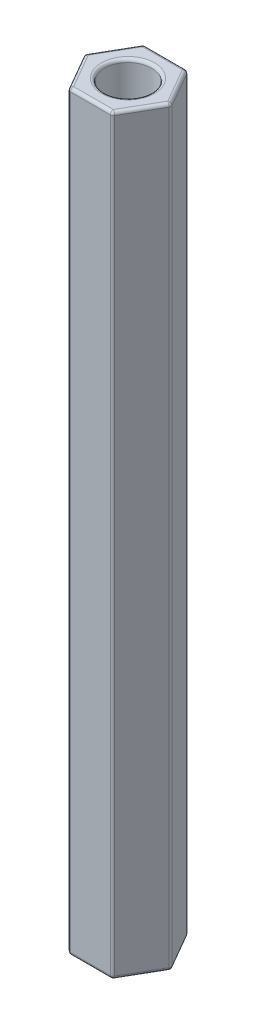
ISO-10303-21;
HEADER;
FILE_DESCRIPTION(('STEP AP214'),'2;1');
FILE_NAME('part.step','',(''),(''),'','','');
FILE_SCHEMA(('AUTOMOTIVE_DESIGN { 1 0 10303 214 1 1 1 1 }'));
ENDSEC;
DATA;
#1=APPLICATION_CONTEXT('core data for automotive mechanical design processes');
#2=APPLICATION_PROTOCOL_DEFINITION('international standard','automotive_design',2000,#1);
#3=PRODUCT_CONTEXT('',#1,'mechanical');
#4=PRODUCT('Part','Part','',(#3));
#5=PRODUCT_RELATED_PRODUCT_CATEGORY('part','',(#4));
#6=PRODUCT_DEFINITION_FORMATION('','',#4);
#7=PRODUCT_DEFINITION_CONTEXT('part definition',#1,'design');
#8=PRODUCT_DEFINITION('design','',#6,#7);
#9=PRODUCT_DEFINITION_SHAPE('','',#8);
#10=(LENGTH_UNIT() NAMED_UNIT(*) SI_UNIT(.MILLI.,.METRE.));
#11=(NAMED_UNIT(*) PLANE_ANGLE_UNIT() SI_UNIT($,.RADIAN.));
#12=(NAMED_UNIT(*) SI_UNIT($,.STERADIAN.) SOLID_ANGLE_UNIT());
#13=UNCERTAINTY_MEASURE_WITH_UNIT(LENGTH_MEASURE(1.E-05),#10,'distance_accuracy_value','');
#14=(GEOMETRIC_REPRESENTATION_CONTEXT(3) GLOBAL_UNCERTAINTY_ASSIGNED_CONTEXT((#13)) GLOBAL_UNIT_ASSIGNED_CONTEXT((#10,
#11,#12)) REPRESENTATION_CONTEXT('',''));
#15=CARTESIAN_POINT('',(0.,0.,0.));
#16=DIRECTION('',(0.,0.,1.));
#17=DIRECTION('',(1.,0.,0.));
#18=AXIS2_PLACEMENT_3D('',#15,#16,#17);
#19=CARTESIAN_POINT('',(0.,30.,0.));
#20=DIRECTION('',(0.,1.,0.));
#21=DIRECTION('',(0.,0.,1.));
#22=AXIS2_PLACEMENT_3D('',#19,#20,#21);
#23=PLANE('',#22);
#24=DIRECTION('',(0.500000000000004,0.,0.866025403784436));
#25=VECTOR('',#24,1.);
#26=CARTESIAN_POINT('',(-1.51554445662275,30.,2.87500000000002));
#27=LINE('',#26,#25);
#28=CARTESIAN_POINT('',(-3.17542648054294,30.,0.));
#29=VERTEX_POINT('',#28);
#30=CARTESIAN_POINT('',(-1.58771324027145,30.,2.75000000000002));
#31=VERTEX_POINT('',#30);
#32=EDGE_CURVE('E174',#29,#31,#27,.T.);
#33=ORIENTED_EDGE('',*,*,#32,.T.);
#34=DIRECTION('',(1.,0.,0.));
#35=VECTOR('',#34,1.);
#36=CARTESIAN_POINT('',(1.73205080756889,30.,2.75000000000001));
#37=LINE('',#36,#35);
#38=CARTESIAN_POINT('',(1.58771324027148,30.,2.75000000000001));
#39=VERTEX_POINT('',#38);
#40=EDGE_CURVE('E252',#31,#39,#37,.T.);
#41=ORIENTED_EDGE('',*,*,#40,.T.);
#42=DIRECTION('',(0.499999999999997,0.,-0.86602540378444));
#43=VECTOR('',#42,1.);
#44=CARTESIAN_POINT('',(3.24759526419165,30.,-0.125));
#45=LINE('',#44,#43);
#46=CARTESIAN_POINT('',(3.17542648054295,30.,0.));
#47=VERTEX_POINT('',#46);
#48=EDGE_CURVE('E250',#39,#47,#45,.T.);
#49=ORIENTED_EDGE('',*,*,#48,.T.);
#50=DIRECTION('',(-0.500000000000002,0.,-0.866025403784437));
#51=VECTOR('',#50,1.);
#52=CARTESIAN_POINT('',(1.51554445662276,30.,-2.87500000000001));
#53=LINE('',#52,#51);
#54=CARTESIAN_POINT('',(1.58771324027146,30.,-2.75000000000001));
#55=VERTEX_POINT('',#54);
#56=EDGE_CURVE('E169',#47,#55,#53,.T.);
#57=ORIENTED_EDGE('',*,*,#56,.T.);
#58=DIRECTION('',(-1.,0.,0.));
#59=VECTOR('',#58,1.);
#60=CARTESIAN_POINT('',(-1.73205080756888,30.,-2.74999999999999));
#61=LINE('',#60,#59);
#62=CARTESIAN_POINT('',(-1.58771324027147,30.,-2.74999999999999));
#63=VERTEX_POINT('',#62);
#64=EDGE_CURVE('E162',#55,#63,#61,.T.);
#65=ORIENTED_EDGE('',*,*,#64,.T.);
#66=DIRECTION('',(-0.499999999999998,0.,0.86602540378444));
#67=VECTOR('',#66,1.);
#68=CARTESIAN_POINT('',(-3.24759526419164,30.,0.125000000000017));
#69=LINE('',#68,#67);
#70=EDGE_CURVE('E165',#63,#29,#69,.T.);
#71=ORIENTED_EDGE('',*,*,#70,.T.);
#72=EDGE_LOOP('',(#33,#41,#49,#57,#65,#71));
#73=FACE_BOUND('',#72,.T.);
#74=CARTESIAN_POINT('',(0.,30.,0.));
#75=DIRECTION('',(0.,1.,0.));
#76=DIRECTION('',(0.,0.,1.));
#77=AXIS2_PLACEMENT_3D('',#74,#75,#76);
#78=CIRCLE('',#77,2.125);
#79=CARTESIAN_POINT('',(0.,30.,2.125));
#80=VERTEX_POINT('',#79);
#81=EDGE_CURVE('E185',#80,#80,#78,.F.);
#82=ORIENTED_EDGE('',*,*,#81,.T.);
#83=EDGE_LOOP('',(#82));
#84=FACE_BOUND('',#83,.T.);
#85=ADVANCED_FACE('F37',(#73,#84),#23,.T.);
#86=CARTESIAN_POINT('',(0.,-30.,0.));
#87=DIRECTION('',(0.,1.,0.));
#88=DIRECTION('',(0.,0.,1.));
#89=AXIS2_PLACEMENT_3D('',#86,#87,#88);
#90=PLANE('',#89);
#91=DIRECTION('',(0.499999999999997,0.,-0.86602540378444));
#92=VECTOR('',#91,1.);
#93=CARTESIAN_POINT('',(2.38156986040722,-30.,1.375));
#94=LINE('',#93,#92);
#95=CARTESIAN_POINT('',(3.17542648054295,-30.,0.));
#96=VERTEX_POINT('',#95);
#97=CARTESIAN_POINT('',(1.58771324027148,-30.,2.75000000000001));
#98=VERTEX_POINT('',#97);
#99=EDGE_CURVE('E274',#96,#98,#94,.F.);
#100=ORIENTED_EDGE('',*,*,#99,.T.);
#101=DIRECTION('',(1.,0.,0.));
#102=VECTOR('',#101,1.);
#103=CARTESIAN_POINT('',(0.,-30.,2.75000000000002));
#104=LINE('',#103,#102);
#105=CARTESIAN_POINT('',(-1.58771324027145,-30.,2.75000000000002));
#106=VERTEX_POINT('',#105);
#107=EDGE_CURVE('E277',#98,#106,#104,.F.);
#108=ORIENTED_EDGE('',*,*,#107,.T.);
#109=DIRECTION('',(0.500000000000004,0.,0.866025403784436));
#110=VECTOR('',#109,1.);
#111=CARTESIAN_POINT('',(-2.3815698604072,-30.,1.37500000000001));
#112=LINE('',#111,#110);
#113=CARTESIAN_POINT('',(-3.17542648054294,-30.,0.));
#114=VERTEX_POINT('',#113);
#115=EDGE_CURVE('E268',#106,#114,#112,.F.);
#116=ORIENTED_EDGE('',*,*,#115,.T.);
#117=DIRECTION('',(-0.499999999999998,0.,0.86602540378444));
#118=VECTOR('',#117,1.);
#119=CARTESIAN_POINT('',(-2.3815698604072,-30.,-1.37499999999999));
#120=LINE('',#119,#118);
#121=CARTESIAN_POINT('',(-1.58771324027147,-30.,-2.74999999999999));
#122=VERTEX_POINT('',#121);
#123=EDGE_CURVE('E266',#114,#122,#120,.F.);
#124=ORIENTED_EDGE('',*,*,#123,.T.);
#125=DIRECTION('',(-1.,0.,0.));
#126=VECTOR('',#125,1.);
#127=CARTESIAN_POINT('',(0.,-30.,-2.75));
#128=LINE('',#127,#126);
#129=CARTESIAN_POINT('',(1.58771324027146,-30.,-2.75000000000001));
#130=VERTEX_POINT('',#129);
#131=EDGE_CURVE('E270',#122,#130,#128,.F.);
#132=ORIENTED_EDGE('',*,*,#131,.T.);
#133=DIRECTION('',(-0.500000000000002,0.,-0.866025403784437));
#134=VECTOR('',#133,1.);
#135=CARTESIAN_POINT('',(2.3815698604072,-30.,-1.37500000000001));
#136=LINE('',#135,#134);
#137=EDGE_CURVE('E272',#130,#96,#136,.F.);
#138=ORIENTED_EDGE('',*,*,#137,.T.);
#139=EDGE_LOOP('',(#100,#108,#116,#124,#132,#138));
#140=FACE_BOUND('',#139,.T.);
#141=CARTESIAN_POINT('',(0.,-30.,0.));
#142=DIRECTION('',(0.,1.,0.));
#143=DIRECTION('',(0.,0.,1.));
#144=AXIS2_PLACEMENT_3D('',#141,#142,#143);
#145=CIRCLE('',#144,2.125);
#146=CARTESIAN_POINT('',(0.,-30.,2.125));
#147=VERTEX_POINT('',#146);
#148=EDGE_CURVE('E263',#147,#147,#145,.T.);
#149=ORIENTED_EDGE('',*,*,#148,.T.);
#150=EDGE_LOOP('',(#149));
#151=FACE_BOUND('',#150,.T.);
#152=ADVANCED_FACE('F434',(#140,#151),#90,.F.);
#153=CARTESIAN_POINT('',(3.46410161513776,30.,0.));
#154=DIRECTION('',(-0.866025403784437,0.,0.500000000000002));
#155=DIRECTION('',(0.500000000000002,0.,0.866025403784437));
#156=AXIS2_PLACEMENT_3D('',#153,#154,#155);
#157=PLANE('',#156);
#158=DIRECTION('',(-0.500000000000002,0.,-0.866025403784437));
#159=VECTOR('',#158,1.);
#160=CARTESIAN_POINT('',(3.46410161513776,29.75,0.));
#161=LINE('',#160,#159);
#162=CARTESIAN_POINT('',(1.80421959121757,29.75,-2.87500000000001));
#163=VERTEX_POINT('',#162);
#164=CARTESIAN_POINT('',(3.39193283148906,29.75,-0.125));
#165=VERTEX_POINT('',#164);
#166=EDGE_CURVE('E283',#163,#165,#161,.F.);
#167=ORIENTED_EDGE('',*,*,#166,.T.);
#168=DIRECTION('',(0.,-1.,0.));
#169=VECTOR('',#168,1.);
#170=CARTESIAN_POINT('',(3.39193283148906,30.,-0.125));
#171=LINE('',#170,#169);
#172=CARTESIAN_POINT('',(3.39193283148906,-29.75,-0.125));
#173=VERTEX_POINT('',#172);
#174=EDGE_CURVE('E285',#165,#173,#171,.T.);
#175=ORIENTED_EDGE('',*,*,#174,.T.);
#176=DIRECTION('',(-0.500000000000002,0.,-0.866025403784437));
#177=VECTOR('',#176,1.);
#178=CARTESIAN_POINT('',(3.46410161513776,-29.75,0.));
#179=LINE('',#178,#177);
#180=CARTESIAN_POINT('',(1.80421959121757,-29.75,-2.87500000000001));
#181=VERTEX_POINT('',#180);
#182=EDGE_CURVE('E281',#173,#181,#179,.T.);
#183=ORIENTED_EDGE('',*,*,#182,.T.);
#184=DIRECTION('',(0.,-1.,0.));
#185=VECTOR('',#184,1.);
#186=CARTESIAN_POINT('',(1.80421959121757,30.,-2.87500000000001));
#187=LINE('',#186,#185);
#188=EDGE_CURVE('E279',#181,#163,#187,.F.);
#189=ORIENTED_EDGE('',*,*,#188,.T.);
#190=EDGE_LOOP('',(#167,#175,#183,#189));
#191=FACE_BOUND('',#190,.T.);
#192=ADVANCED_FACE('F389',(#191),#157,.F.);
#193=CARTESIAN_POINT('',(1.73205080756887,30.,-3.00000000000001));
#194=DIRECTION('',(0.,0.,1.));
#195=DIRECTION('',(1.,0.,0.));
#196=AXIS2_PLACEMENT_3D('',#193,#194,#195);
#197=PLANE('',#196);
#198=DIRECTION('',(-1.,0.,0.));
#199=VECTOR('',#198,1.);
#200=CARTESIAN_POINT('',(1.73205080756887,29.75,-3.00000000000001));
#201=LINE('',#200,#199);
#202=CARTESIAN_POINT('',(-1.58771324027147,29.75,-2.99999999999999));
#203=VERTEX_POINT('',#202);
#204=CARTESIAN_POINT('',(1.58771324027146,29.75,-3.00000000000001));
#205=VERTEX_POINT('',#204);
#206=EDGE_CURVE('E196',#203,#205,#201,.F.);
#207=ORIENTED_EDGE('',*,*,#206,.T.);
#208=DIRECTION('',(0.,-1.,0.));
#209=VECTOR('',#208,1.);
#210=CARTESIAN_POINT('',(1.58771324027146,30.,-3.00000000000001));
#211=LINE('',#210,#209);
#212=CARTESIAN_POINT('',(1.58771324027146,-29.75,-3.00000000000001));
#213=VERTEX_POINT('',#212);
#214=EDGE_CURVE('E293',#205,#213,#211,.T.);
#215=ORIENTED_EDGE('',*,*,#214,.T.);
#216=DIRECTION('',(-1.,0.,0.));
#217=VECTOR('',#216,1.);
#218=CARTESIAN_POINT('',(1.73205080756887,-29.75,-3.00000000000001));
#219=LINE('',#218,#217);
#220=CARTESIAN_POINT('',(-1.58771324027147,-29.75,-2.99999999999999));
#221=VERTEX_POINT('',#220);
#222=EDGE_CURVE('E290',#213,#221,#219,.T.);
#223=ORIENTED_EDGE('',*,*,#222,.T.);
#224=DIRECTION('',(0.,-1.,0.));
#225=VECTOR('',#224,1.);
#226=CARTESIAN_POINT('',(-1.58771324027147,30.,-2.99999999999999));
#227=LINE('',#226,#225);
#228=EDGE_CURVE('E288',#221,#203,#227,.F.);
#229=ORIENTED_EDGE('',*,*,#228,.T.);
#230=EDGE_LOOP('',(#207,#215,#223,#229));
#231=FACE_BOUND('',#230,.T.);
#232=ADVANCED_FACE('F457',(#231),#197,.F.);
#233=CARTESIAN_POINT('',(-1.73205080756888,30.,-2.99999999999999));
#234=DIRECTION('',(0.86602540378444,0.,0.499999999999998));
#235=DIRECTION('',(0.499999999999998,0.,-0.86602540378444));
#236=AXIS2_PLACEMENT_3D('',#233,#234,#235);
#237=PLANE('',#236);
#238=DIRECTION('',(-0.499999999999998,0.,0.86602540378444));
#239=VECTOR('',#238,1.);
#240=CARTESIAN_POINT('',(-1.73205080756888,29.75,-2.99999999999999));
#241=LINE('',#240,#239);
#242=CARTESIAN_POINT('',(-3.39193283148905,29.75,-0.124999999999983));
#243=VERTEX_POINT('',#242);
#244=CARTESIAN_POINT('',(-1.80421959121758,29.75,-2.87499999999999));
#245=VERTEX_POINT('',#244);
#246=EDGE_CURVE('E54',#243,#245,#241,.F.);
#247=ORIENTED_EDGE('',*,*,#246,.T.);
#248=DIRECTION('',(0.,-1.,0.));
#249=VECTOR('',#248,1.);
#250=CARTESIAN_POINT('',(-1.80421959121758,30.,-2.87499999999999));
#251=LINE('',#250,#249);
#252=CARTESIAN_POINT('',(-1.80421959121758,-29.75,-2.87499999999999));
#253=VERTEX_POINT('',#252);
#254=EDGE_CURVE('E318',#245,#253,#251,.T.);
#255=ORIENTED_EDGE('',*,*,#254,.T.);
#256=DIRECTION('',(-0.499999999999998,0.,0.86602540378444));
#257=VECTOR('',#256,1.);
#258=CARTESIAN_POINT('',(-1.73205080756888,-29.75,-2.99999999999999));
#259=LINE('',#258,#257);
#260=CARTESIAN_POINT('',(-3.39193283148905,-29.75,-0.124999999999983));
#261=VERTEX_POINT('',#260);
#262=EDGE_CURVE('E314',#253,#261,#259,.T.);
#263=ORIENTED_EDGE('',*,*,#262,.T.);
#264=DIRECTION('',(0.,-1.,0.));
#265=VECTOR('',#264,1.);
#266=CARTESIAN_POINT('',(-3.39193283148905,30.,-0.124999999999983));
#267=LINE('',#266,#265);
#268=EDGE_CURVE('E59',#261,#243,#267,.F.);
#269=ORIENTED_EDGE('',*,*,#268,.T.);
#270=EDGE_LOOP('',(#247,#255,#263,#269));
#271=FACE_BOUND('',#270,.T.);
#272=ADVANCED_FACE('F453',(#271),#237,.F.);
#273=CARTESIAN_POINT('',(-3.46410161513775,30.,0.));
#274=DIRECTION('',(0.866025403784436,0.,-0.500000000000004));
#275=DIRECTION('',(-0.500000000000004,0.,-0.866025403784436));
#276=AXIS2_PLACEMENT_3D('',#273,#274,#275);
#277=PLANE('',#276);
#278=DIRECTION('',(0.500000000000004,0.,0.866025403784436));
#279=VECTOR('',#278,1.);
#280=CARTESIAN_POINT('',(-3.46410161513775,-29.75,0.));
#281=LINE('',#280,#279);
#282=CARTESIAN_POINT('',(-3.39193283148905,-29.75,0.125000000000017));
#283=VERTEX_POINT('',#282);
#284=CARTESIAN_POINT('',(-1.80421959121756,-29.75,2.87500000000002));
#285=VERTEX_POINT('',#284);
#286=EDGE_CURVE('E298',#283,#285,#281,.T.);
#287=ORIENTED_EDGE('',*,*,#286,.T.);
#288=DIRECTION('',(0.,-1.,0.));
#289=VECTOR('',#288,1.);
#290=CARTESIAN_POINT('',(-1.80421959121756,30.,2.87500000000002));
#291=LINE('',#290,#289);
#292=CARTESIAN_POINT('',(-1.80421959121756,29.75,2.87500000000002));
#293=VERTEX_POINT('',#292);
#294=EDGE_CURVE('E303',#285,#293,#291,.F.);
#295=ORIENTED_EDGE('',*,*,#294,.T.);
#296=DIRECTION('',(0.500000000000004,0.,0.866025403784436));
#297=VECTOR('',#296,1.);
#298=CARTESIAN_POINT('',(-3.46410161513775,29.75,0.));
#299=LINE('',#298,#297);
#300=CARTESIAN_POINT('',(-3.39193283148905,29.75,0.125000000000017));
#301=VERTEX_POINT('',#300);
#302=EDGE_CURVE('E300',#293,#301,#299,.F.);
#303=ORIENTED_EDGE('',*,*,#302,.T.);
#304=DIRECTION('',(0.,-1.,0.));
#305=VECTOR('',#304,1.);
#306=CARTESIAN_POINT('',(-3.39193283148905,30.,0.125000000000017));
#307=LINE('',#306,#305);
#308=EDGE_CURVE('E296',#301,#283,#307,.T.);
#309=ORIENTED_EDGE('',*,*,#308,.T.);
#310=EDGE_LOOP('',(#287,#295,#303,#309));
#311=FACE_BOUND('',#310,.T.);
#312=ADVANCED_FACE('F449',(#311),#277,.F.);
#313=CARTESIAN_POINT('',(-1.73205080756885,30.,3.00000000000002));
#314=DIRECTION('',(0.,0.,-1.));
#315=DIRECTION('',(-1.,0.,0.));
#316=AXIS2_PLACEMENT_3D('',#313,#314,#315);
#317=PLANE('',#316);
#318=DIRECTION('',(1.,0.,0.));
#319=VECTOR('',#318,1.);
#320=CARTESIAN_POINT('',(-1.73205080756885,29.75,3.00000000000002));
#321=LINE('',#320,#319);
#322=CARTESIAN_POINT('',(1.58771324027148,29.75,3.00000000000001));
#323=VERTEX_POINT('',#322);
#324=CARTESIAN_POINT('',(-1.58771324027145,29.75,3.00000000000002));
#325=VERTEX_POINT('',#324);
#326=EDGE_CURVE('E309',#323,#325,#321,.F.);
#327=ORIENTED_EDGE('',*,*,#326,.T.);
#328=DIRECTION('',(0.,-1.,0.));
#329=VECTOR('',#328,1.);
#330=CARTESIAN_POINT('',(-1.58771324027145,30.,3.00000000000002));
#331=LINE('',#330,#329);
#332=CARTESIAN_POINT('',(-1.58771324027145,-29.75,3.00000000000002));
#333=VERTEX_POINT('',#332);
#334=EDGE_CURVE('E311',#325,#333,#331,.T.);
#335=ORIENTED_EDGE('',*,*,#334,.T.);
#336=DIRECTION('',(1.,0.,0.));
#337=VECTOR('',#336,1.);
#338=CARTESIAN_POINT('',(-1.73205080756885,-29.75,3.00000000000002));
#339=LINE('',#338,#337);
#340=CARTESIAN_POINT('',(1.58771324027148,-29.75,3.00000000000001));
#341=VERTEX_POINT('',#340);
#342=EDGE_CURVE('E305',#333,#341,#339,.T.);
#343=ORIENTED_EDGE('',*,*,#342,.T.);
#344=DIRECTION('',(0.,-1.,0.));
#345=VECTOR('',#344,1.);
#346=CARTESIAN_POINT('',(1.58771324027148,30.,3.00000000000001));
#347=LINE('',#346,#345);
#348=EDGE_CURVE('E307',#341,#323,#347,.F.);
#349=ORIENTED_EDGE('',*,*,#348,.T.);
#350=EDGE_LOOP('',(#327,#335,#343,#349));
#351=FACE_BOUND('',#350,.T.);
#352=ADVANCED_FACE('F446',(#351),#317,.F.);
#353=CARTESIAN_POINT('',(1.73205080756889,30.,3.00000000000001));
#354=DIRECTION('',(-0.86602540378444,0.,-0.499999999999997));
#355=DIRECTION('',(-0.499999999999997,0.,0.86602540378444));
#356=AXIS2_PLACEMENT_3D('',#353,#354,#355);
#357=PLANE('',#356);
#358=DIRECTION('',(0.499999999999997,0.,-0.86602540378444));
#359=VECTOR('',#358,1.);
#360=CARTESIAN_POINT('',(1.73205080756889,-29.75,3.00000000000001));
#361=LINE('',#360,#359);
#362=CARTESIAN_POINT('',(1.80421959121759,-29.75,2.87500000000001));
#363=VERTEX_POINT('',#362);
#364=CARTESIAN_POINT('',(3.39193283148906,-29.75,0.125));
#365=VERTEX_POINT('',#364);
#366=EDGE_CURVE('E256',#363,#365,#361,.T.);
#367=ORIENTED_EDGE('',*,*,#366,.T.);
#368=DIRECTION('',(0.,-1.,0.));
#369=VECTOR('',#368,1.);
#370=CARTESIAN_POINT('',(3.39193283148906,30.,0.125));
#371=LINE('',#370,#369);
#372=CARTESIAN_POINT('',(3.39193283148906,29.75,0.125));
#373=VERTEX_POINT('',#372);
#374=EDGE_CURVE('E261',#365,#373,#371,.F.);
#375=ORIENTED_EDGE('',*,*,#374,.T.);
#376=DIRECTION('',(0.499999999999997,0.,-0.86602540378444));
#377=VECTOR('',#376,1.);
#378=CARTESIAN_POINT('',(1.73205080756889,29.75,3.00000000000001));
#379=LINE('',#378,#377);
#380=CARTESIAN_POINT('',(1.80421959121759,29.75,2.87500000000001));
#381=VERTEX_POINT('',#380);
#382=EDGE_CURVE('E258',#373,#381,#379,.F.);
#383=ORIENTED_EDGE('',*,*,#382,.T.);
#384=DIRECTION('',(0.,-1.,0.));
#385=VECTOR('',#384,1.);
#386=CARTESIAN_POINT('',(1.80421959121759,30.,2.87500000000001));
#387=LINE('',#386,#385);
#388=EDGE_CURVE('E254',#381,#363,#387,.T.);
#389=ORIENTED_EDGE('',*,*,#388,.T.);
#390=EDGE_LOOP('',(#367,#375,#383,#389));
#391=FACE_BOUND('',#390,.T.);
#392=ADVANCED_FACE('F409',(#391),#357,.F.);
#393=CARTESIAN_POINT('',(0.,30.,0.));
#394=DIRECTION('',(0.,-1.,0.));
#395=DIRECTION('',(0.,0.,-1.));
#396=AXIS2_PLACEMENT_3D('',#393,#394,#395);
#397=CYLINDRICAL_SURFACE('',#396,1.875);
#398=CARTESIAN_POINT('',(0.,-29.75,0.));
#399=DIRECTION('',(0.,1.,0.));
#400=DIRECTION('',(0.,0.,1.));
#401=AXIS2_PLACEMENT_3D('',#398,#399,#400);
#402=CIRCLE('',#401,1.875);
#403=CARTESIAN_POINT('',(0.,-29.75,1.875));
#404=VERTEX_POINT('',#403);
#405=EDGE_CURVE('E11',#404,#404,#402,.F.);
#406=ORIENTED_EDGE('',*,*,#405,.T.);
#407=EDGE_LOOP('',(#406));
#408=FACE_BOUND('',#407,.T.);
#409=CARTESIAN_POINT('',(0.,29.75,0.));
#410=DIRECTION('',(0.,1.,0.));
#411=DIRECTION('',(0.,0.,1.));
#412=AXIS2_PLACEMENT_3D('',#409,#410,#411);
#413=CIRCLE('',#412,1.875);
#414=CARTESIAN_POINT('',(0.,29.75,1.875));
#415=VERTEX_POINT('',#414);
#416=EDGE_CURVE('E46',#415,#415,#413,.T.);
#417=ORIENTED_EDGE('',*,*,#416,.T.);
#418=EDGE_LOOP('',(#417));
#419=FACE_BOUND('',#418,.T.);
#420=ADVANCED_FACE('F442',(#408,#419),#397,.F.);
#421=CARTESIAN_POINT('',(-1.51554445662277,-29.75,-2.87499999999999));
#422=DIRECTION('',(-0.499999999999998,0.,0.86602540378444));
#423=DIRECTION('',(0.86602540378444,0.,0.499999999999998));
#424=AXIS2_PLACEMENT_3D('',#421,#422,#423);
#425=CYLINDRICAL_SURFACE('',#424,0.25);
#426=CARTESIAN_POINT('',(-3.17542648054294,-29.75,0.));
#427=DIRECTION('',(-0.499999999999997,0.,0.86602540378444));
#428=DIRECTION('',(0.86602540378444,0.,0.499999999999997));
#429=AXIS2_PLACEMENT_3D('',#426,#427,#428);
#430=CIRCLE('',#429,0.25);
#431=EDGE_CURVE('E41',#261,#114,#430,.T.);
#432=ORIENTED_EDGE('',*,*,#431,.F.);
#433=ORIENTED_EDGE('',*,*,#262,.F.);
#434=CARTESIAN_POINT('',(-1.58771324027147,-29.75,-2.74999999999999));
#435=DIRECTION('',(0.499999999999997,0.,-0.86602540378444));
#436=DIRECTION('',(-0.86602540378444,0.,-0.499999999999997));
#437=AXIS2_PLACEMENT_3D('',#434,#435,#436);
#438=CIRCLE('',#437,0.25);
#439=EDGE_CURVE('E232',#122,#253,#438,.T.);
#440=ORIENTED_EDGE('',*,*,#439,.F.);
#441=ORIENTED_EDGE('',*,*,#123,.F.);
#442=EDGE_LOOP('',(#432,#433,#440,#441));
#443=FACE_BOUND('',#442,.T.);
#444=ADVANCED_FACE('F512',(#443),#425,.T.);
#445=CARTESIAN_POINT('',(-3.17542648054294,-29.75,0.));
#446=DIRECTION('',(0.,0.,1.));
#447=DIRECTION('',(1.,0.,0.));
#448=AXIS2_PLACEMENT_3D('',#445,#446,#447);
#449=SPHERICAL_SURFACE('',#448,0.25);
#450=CARTESIAN_POINT('',(-3.17542648054294,-29.75,0.));
#451=DIRECTION('',(0.,-1.,0.));
#452=DIRECTION('',(0.,0.,-1.));
#453=AXIS2_PLACEMENT_3D('',#450,#451,#452);
#454=CIRCLE('',#453,0.25);
#455=EDGE_CURVE('E227',#261,#283,#454,.F.);
#456=ORIENTED_EDGE('',*,*,#455,.F.);
#457=ORIENTED_EDGE('',*,*,#431,.T.);
#458=CARTESIAN_POINT('',(-3.17542648054294,-29.75,0.));
#459=DIRECTION('',(-0.500000000000002,0.,-0.866025403784438));
#460=DIRECTION('',(-0.866025403784438,0.,0.500000000000002));
#461=AXIS2_PLACEMENT_3D('',#458,#459,#460);
#462=CIRCLE('',#461,0.25);
#463=EDGE_CURVE('E230',#283,#114,#462,.F.);
#464=ORIENTED_EDGE('',*,*,#463,.F.);
#465=EDGE_LOOP('',(#456,#457,#464));
#466=FACE_BOUND('',#465,.T.);
#467=ADVANCED_FACE('F513',(#466),#449,.T.);
#468=CARTESIAN_POINT('',(-1.58771324027147,-29.75,-2.74999999999999));
#469=DIRECTION('',(0.,0.,1.));
#470=DIRECTION('',(1.,0.,0.));
#471=AXIS2_PLACEMENT_3D('',#468,#469,#470);
#472=SPHERICAL_SURFACE('',#471,0.25);
#473=CARTESIAN_POINT('',(-1.58771324027147,-29.75,-2.74999999999999));
#474=DIRECTION('',(-1.,0.,0.));
#475=DIRECTION('',(0.,0.,1.));
#476=AXIS2_PLACEMENT_3D('',#473,#474,#475);
#477=CIRCLE('',#476,0.25);
#478=EDGE_CURVE('E222',#122,#221,#477,.F.);
#479=ORIENTED_EDGE('',*,*,#478,.F.);
#480=ORIENTED_EDGE('',*,*,#439,.T.);
#481=CARTESIAN_POINT('',(-1.58771324027147,-29.75,-2.74999999999999));
#482=DIRECTION('',(0.,-1.,0.));
#483=DIRECTION('',(0.,0.,-1.));
#484=AXIS2_PLACEMENT_3D('',#481,#482,#483);
#485=CIRCLE('',#484,0.25);
#486=EDGE_CURVE('E225',#221,#253,#485,.F.);
#487=ORIENTED_EDGE('',*,*,#486,.F.);
#488=EDGE_LOOP('',(#479,#480,#487));
#489=FACE_BOUND('',#488,.T.);
#490=ADVANCED_FACE('F548',(#489),#472,.T.);
#491=CARTESIAN_POINT('',(-3.24759526419164,-29.75,-0.124999999999983));
#492=DIRECTION('',(0.500000000000004,0.,0.866025403784436));
#493=DIRECTION('',(0.866025403784436,0.,-0.500000000000004));
#494=AXIS2_PLACEMENT_3D('',#491,#492,#493);
#495=CYLINDRICAL_SURFACE('',#494,0.25);
#496=ORIENTED_EDGE('',*,*,#463,.T.);
#497=ORIENTED_EDGE('',*,*,#115,.F.);
#498=CARTESIAN_POINT('',(-1.58771324027145,-29.75,2.75000000000002));
#499=DIRECTION('',(0.500000000000004,0.,0.866025403784436));
#500=DIRECTION('',(0.866025403784437,0.,-0.500000000000004));
#501=AXIS2_PLACEMENT_3D('',#498,#499,#500);
#502=CIRCLE('',#501,0.25);
#503=EDGE_CURVE('E219',#285,#106,#502,.T.);
#504=ORIENTED_EDGE('',*,*,#503,.F.);
#505=ORIENTED_EDGE('',*,*,#286,.F.);
#506=EDGE_LOOP('',(#496,#497,#504,#505));
#507=FACE_BOUND('',#506,.T.);
#508=ADVANCED_FACE('F527',(#507),#495,.T.);
#509=CARTESIAN_POINT('',(-3.17542648054294,30.,0.));
#510=DIRECTION('',(0.,-1.,0.));
#511=DIRECTION('',(0.,0.,-1.));
#512=AXIS2_PLACEMENT_3D('',#509,#510,#511);
#513=CYLINDRICAL_SURFACE('',#512,0.25);
#514=ORIENTED_EDGE('',*,*,#455,.T.);
#515=ORIENTED_EDGE('',*,*,#308,.F.);
#516=CARTESIAN_POINT('',(-3.17542648054294,29.75,0.));
#517=DIRECTION('',(0.,1.,0.));
#518=DIRECTION('',(0.,0.,1.));
#519=AXIS2_PLACEMENT_3D('',#516,#517,#518);
#520=CIRCLE('',#519,0.25);
#521=EDGE_CURVE('E216',#243,#301,#520,.T.);
#522=ORIENTED_EDGE('',*,*,#521,.F.);
#523=ORIENTED_EDGE('',*,*,#268,.F.);
#524=EDGE_LOOP('',(#514,#515,#522,#523));
#525=FACE_BOUND('',#524,.T.);
#526=ADVANCED_FACE('F518',(#525),#513,.T.);
#527=CARTESIAN_POINT('',(-2.3815698604072,29.75,-1.37499999999999));
#528=DIRECTION('',(0.499999999999998,0.,-0.86602540378444));
#529=DIRECTION('',(-0.86602540378444,0.,-0.499999999999998));
#530=AXIS2_PLACEMENT_3D('',#527,#528,#529);
#531=CYLINDRICAL_SURFACE('',#530,0.25);
#532=CARTESIAN_POINT('',(-1.58771324027147,29.75,-2.74999999999999));
#533=DIRECTION('',(0.499999999999997,0.,-0.86602540378444));
#534=DIRECTION('',(-0.86602540378444,0.,-0.499999999999997));
#535=AXIS2_PLACEMENT_3D('',#532,#533,#534);
#536=CIRCLE('',#535,0.25);
#537=EDGE_CURVE('E180',#245,#63,#536,.T.);
#538=ORIENTED_EDGE('',*,*,#537,.F.);
#539=ORIENTED_EDGE('',*,*,#246,.F.);
#540=CARTESIAN_POINT('',(-3.17542648054294,29.75,0.));
#541=DIRECTION('',(-0.499999999999995,0.,0.866025403784441));
#542=DIRECTION('',(0.866025403784441,0.,0.499999999999995));
#543=AXIS2_PLACEMENT_3D('',#540,#541,#542);
#544=CIRCLE('',#543,0.25);
#545=EDGE_CURVE('E183',#29,#243,#544,.T.);
#546=ORIENTED_EDGE('',*,*,#545,.F.);
#547=ORIENTED_EDGE('',*,*,#70,.F.);
#548=EDGE_LOOP('',(#538,#539,#546,#547));
#549=FACE_BOUND('',#548,.T.);
#550=ADVANCED_FACE('F179',(#549),#531,.T.);
#551=CARTESIAN_POINT('',(-1.58771324027147,30.,-2.74999999999999));
#552=DIRECTION('',(0.,-1.,0.));
#553=DIRECTION('',(0.,0.,-1.));
#554=AXIS2_PLACEMENT_3D('',#551,#552,#553);
#555=CYLINDRICAL_SURFACE('',#554,0.25);
#556=ORIENTED_EDGE('',*,*,#486,.T.);
#557=ORIENTED_EDGE('',*,*,#254,.F.);
#558=CARTESIAN_POINT('',(-1.58771324027147,29.75,-2.74999999999999));
#559=DIRECTION('',(0.,1.,0.));
#560=DIRECTION('',(0.,0.,1.));
#561=AXIS2_PLACEMENT_3D('',#558,#559,#560);
#562=CIRCLE('',#561,0.25);
#563=EDGE_CURVE('E193',#203,#245,#562,.T.);
#564=ORIENTED_EDGE('',*,*,#563,.F.);
#565=ORIENTED_EDGE('',*,*,#228,.F.);
#566=EDGE_LOOP('',(#556,#557,#564,#565));
#567=FACE_BOUND('',#566,.T.);
#568=ADVANCED_FACE('F510',(#567),#555,.T.);
#569=CARTESIAN_POINT('',(1.73205080756887,-29.75,-2.75000000000001));
#570=DIRECTION('',(-1.,0.,0.));
#571=DIRECTION('',(0.,0.,1.));
#572=AXIS2_PLACEMENT_3D('',#569,#570,#571);
#573=CYLINDRICAL_SURFACE('',#572,0.25);
#574=ORIENTED_EDGE('',*,*,#478,.T.);
#575=ORIENTED_EDGE('',*,*,#222,.F.);
#576=CARTESIAN_POINT('',(1.58771324027146,-29.75,-2.75000000000001));
#577=DIRECTION('',(1.,0.,0.));
#578=DIRECTION('',(0.,0.,-1.));
#579=AXIS2_PLACEMENT_3D('',#576,#577,#578);
#580=CIRCLE('',#579,0.25);
#581=EDGE_CURVE('E211',#130,#213,#580,.T.);
#582=ORIENTED_EDGE('',*,*,#581,.F.);
#583=ORIENTED_EDGE('',*,*,#131,.F.);
#584=EDGE_LOOP('',(#574,#575,#582,#583));
#585=FACE_BOUND('',#584,.T.);
#586=ADVANCED_FACE('F507',(#585),#573,.T.);
#587=CARTESIAN_POINT('',(-1.58771324027145,-29.75,2.75000000000002));
#588=DIRECTION('',(0.,0.,1.));
#589=DIRECTION('',(1.,0.,0.));
#590=AXIS2_PLACEMENT_3D('',#587,#588,#589);
#591=SPHERICAL_SURFACE('',#590,0.25);
#592=CARTESIAN_POINT('',(-1.58771324027145,-29.75,2.75000000000002));
#593=DIRECTION('',(0.,-1.,0.));
#594=DIRECTION('',(0.,0.,-1.));
#595=AXIS2_PLACEMENT_3D('',#592,#593,#594);
#596=CIRCLE('',#595,0.25);
#597=EDGE_CURVE('E200',#285,#333,#596,.F.);
#598=ORIENTED_EDGE('',*,*,#597,.F.);
#599=ORIENTED_EDGE('',*,*,#503,.T.);
#600=CARTESIAN_POINT('',(-1.58771324027145,-29.75,2.75000000000002));
#601=DIRECTION('',(-1.,0.,0.));
#602=DIRECTION('',(0.,0.,1.));
#603=AXIS2_PLACEMENT_3D('',#600,#601,#602);
#604=CIRCLE('',#603,0.25);
#605=EDGE_CURVE('E208',#333,#106,#604,.F.);
#606=ORIENTED_EDGE('',*,*,#605,.F.);
#607=EDGE_LOOP('',(#598,#599,#606));
#608=FACE_BOUND('',#607,.T.);
#609=ADVANCED_FACE('F529',(#608),#591,.T.);
#610=CARTESIAN_POINT('',(-3.17542648054294,29.75,0.));
#611=DIRECTION('',(0.,0.,1.));
#612=DIRECTION('',(1.,0.,0.));
#613=AXIS2_PLACEMENT_3D('',#610,#611,#612);
#614=SPHERICAL_SURFACE('',#613,0.25);
#615=ORIENTED_EDGE('',*,*,#545,.T.);
#616=ORIENTED_EDGE('',*,*,#521,.T.);
#617=CARTESIAN_POINT('',(-3.17542648054294,29.75,0.));
#618=DIRECTION('',(-0.500000000000004,0.,-0.866025403784436));
#619=DIRECTION('',(-0.866025403784436,0.,0.500000000000004));
#620=AXIS2_PLACEMENT_3D('',#617,#618,#619);
#621=CIRCLE('',#620,0.25);
#622=EDGE_CURVE('E197',#29,#301,#621,.F.);
#623=ORIENTED_EDGE('',*,*,#622,.F.);
#624=EDGE_LOOP('',(#615,#616,#623));
#625=FACE_BOUND('',#624,.T.);
#626=ADVANCED_FACE('F520',(#625),#614,.T.);
#627=CARTESIAN_POINT('',(-1.58771324027147,29.75,-2.74999999999999));
#628=DIRECTION('',(0.,0.,1.));
#629=DIRECTION('',(1.,0.,0.));
#630=AXIS2_PLACEMENT_3D('',#627,#628,#629);
#631=SPHERICAL_SURFACE('',#630,0.25);
#632=ORIENTED_EDGE('',*,*,#563,.T.);
#633=ORIENTED_EDGE('',*,*,#537,.T.);
#634=CARTESIAN_POINT('',(-1.58771324027147,29.75,-2.74999999999999));
#635=DIRECTION('',(-1.,0.,0.));
#636=DIRECTION('',(0.,0.,1.));
#637=AXIS2_PLACEMENT_3D('',#634,#635,#636);
#638=CIRCLE('',#637,0.25);
#639=EDGE_CURVE('E190',#203,#63,#638,.F.);
#640=ORIENTED_EDGE('',*,*,#639,.F.);
#641=EDGE_LOOP('',(#632,#633,#640));
#642=FACE_BOUND('',#641,.T.);
#643=ADVANCED_FACE('F189',(#642),#631,.T.);
#644=CARTESIAN_POINT('',(1.58771324027146,-29.75,-2.75000000000001));
#645=DIRECTION('',(0.,0.,1.));
#646=DIRECTION('',(1.,0.,0.));
#647=AXIS2_PLACEMENT_3D('',#644,#645,#646);
#648=SPHERICAL_SURFACE('',#647,0.25);
#649=CARTESIAN_POINT('',(1.58771324027146,-29.75,-2.75000000000001));
#650=DIRECTION('',(-0.500000000000002,0.,-0.866025403784437));
#651=DIRECTION('',(-0.866025403784437,0.,0.500000000000002));
#652=AXIS2_PLACEMENT_3D('',#649,#650,#651);
#653=CIRCLE('',#652,0.25);
#654=EDGE_CURVE('E202',#130,#181,#653,.F.);
#655=ORIENTED_EDGE('',*,*,#654,.F.);
#656=ORIENTED_EDGE('',*,*,#581,.T.);
#657=CARTESIAN_POINT('',(1.58771324027146,-29.75,-2.75000000000001));
#658=DIRECTION('',(0.,-1.,0.));
#659=DIRECTION('',(0.,0.,-1.));
#660=AXIS2_PLACEMENT_3D('',#657,#658,#659);
#661=CIRCLE('',#660,0.25);
#662=EDGE_CURVE('E198',#181,#213,#661,.F.);
#663=ORIENTED_EDGE('',*,*,#662,.F.);
#664=EDGE_LOOP('',(#655,#656,#663));
#665=FACE_BOUND('',#664,.T.);
#666=ADVANCED_FACE('F380',(#665),#648,.T.);
#667=CARTESIAN_POINT('',(-1.73205080756885,-29.75,2.75000000000002));
#668=DIRECTION('',(1.,0.,0.));
#669=DIRECTION('',(0.,0.,-1.));
#670=AXIS2_PLACEMENT_3D('',#667,#668,#669);
#671=CYLINDRICAL_SURFACE('',#670,0.25);
#672=ORIENTED_EDGE('',*,*,#605,.T.);
#673=ORIENTED_EDGE('',*,*,#107,.F.);
#674=CARTESIAN_POINT('',(1.58771324027148,-29.75,2.75000000000001));
#675=DIRECTION('',(1.,0.,0.));
#676=DIRECTION('',(0.,0.,-1.));
#677=AXIS2_PLACEMENT_3D('',#674,#675,#676);
#678=CIRCLE('',#677,0.25);
#679=EDGE_CURVE('E366',#341,#98,#678,.T.);
#680=ORIENTED_EDGE('',*,*,#679,.F.);
#681=ORIENTED_EDGE('',*,*,#342,.F.);
#682=EDGE_LOOP('',(#672,#673,#680,#681));
#683=FACE_BOUND('',#682,.T.);
#684=ADVANCED_FACE('F500',(#683),#671,.T.);
#685=CARTESIAN_POINT('',(-1.58771324027145,30.,2.75000000000002));
#686=DIRECTION('',(0.,-1.,0.));
#687=DIRECTION('',(0.,0.,-1.));
#688=AXIS2_PLACEMENT_3D('',#685,#686,#687);
#689=CYLINDRICAL_SURFACE('',#688,0.25);
#690=ORIENTED_EDGE('',*,*,#597,.T.);
#691=ORIENTED_EDGE('',*,*,#334,.F.);
#692=CARTESIAN_POINT('',(-1.58771324027145,29.75,2.75000000000002));
#693=DIRECTION('',(0.,1.,0.));
#694=DIRECTION('',(0.,0.,1.));
#695=AXIS2_PLACEMENT_3D('',#692,#693,#694);
#696=CIRCLE('',#695,0.25);
#697=EDGE_CURVE('E363',#293,#325,#696,.T.);
#698=ORIENTED_EDGE('',*,*,#697,.F.);
#699=ORIENTED_EDGE('',*,*,#294,.F.);
#700=EDGE_LOOP('',(#690,#691,#698,#699));
#701=FACE_BOUND('',#700,.T.);
#702=ADVANCED_FACE('F491',(#701),#689,.T.);
#703=CARTESIAN_POINT('',(-2.3815698604072,29.75,1.37500000000001));
#704=DIRECTION('',(-0.500000000000004,0.,-0.866025403784436));
#705=DIRECTION('',(-0.866025403784436,0.,0.500000000000004));
#706=AXIS2_PLACEMENT_3D('',#703,#704,#705);
#707=CYLINDRICAL_SURFACE('',#706,0.25);
#708=ORIENTED_EDGE('',*,*,#622,.T.);
#709=ORIENTED_EDGE('',*,*,#302,.F.);
#710=CARTESIAN_POINT('',(-1.58771324027145,29.75,2.75000000000002));
#711=DIRECTION('',(0.500000000000003,0.,0.866025403784437));
#712=DIRECTION('',(0.866025403784437,0.,-0.500000000000003));
#713=AXIS2_PLACEMENT_3D('',#710,#711,#712);
#714=CIRCLE('',#713,0.25);
#715=EDGE_CURVE('E360',#31,#293,#714,.T.);
#716=ORIENTED_EDGE('',*,*,#715,.F.);
#717=ORIENTED_EDGE('',*,*,#32,.F.);
#718=EDGE_LOOP('',(#708,#709,#716,#717));
#719=FACE_BOUND('',#718,.T.);
#720=ADVANCED_FACE('F524',(#719),#707,.T.);
#721=CARTESIAN_POINT('',(0.,29.75,-2.75));
#722=DIRECTION('',(1.,0.,0.));
#723=DIRECTION('',(0.,0.,-1.));
#724=AXIS2_PLACEMENT_3D('',#721,#722,#723);
#725=CYLINDRICAL_SURFACE('',#724,0.25);
#726=ORIENTED_EDGE('',*,*,#639,.T.);
#727=ORIENTED_EDGE('',*,*,#64,.F.);
#728=CARTESIAN_POINT('',(1.58771324027146,29.75,-2.75000000000001));
#729=DIRECTION('',(1.,0.,0.));
#730=DIRECTION('',(0.,0.,-1.));
#731=AXIS2_PLACEMENT_3D('',#728,#729,#730);
#732=CIRCLE('',#731,0.25);
#733=EDGE_CURVE('E358',#205,#55,#732,.T.);
#734=ORIENTED_EDGE('',*,*,#733,.F.);
#735=ORIENTED_EDGE('',*,*,#206,.F.);
#736=EDGE_LOOP('',(#726,#727,#734,#735));
#737=FACE_BOUND('',#736,.T.);
#738=ADVANCED_FACE('F195',(#737),#725,.T.);
#739=CARTESIAN_POINT('',(1.58771324027146,30.,-2.75000000000001));
#740=DIRECTION('',(0.,-1.,0.));
#741=DIRECTION('',(0.,0.,-1.));
#742=AXIS2_PLACEMENT_3D('',#739,#740,#741);
#743=CYLINDRICAL_SURFACE('',#742,0.25);
#744=ORIENTED_EDGE('',*,*,#662,.T.);
#745=ORIENTED_EDGE('',*,*,#214,.F.);
#746=CARTESIAN_POINT('',(1.58771324027146,29.75,-2.75000000000001));
#747=DIRECTION('',(0.,1.,0.));
#748=DIRECTION('',(0.,0.,1.));
#749=AXIS2_PLACEMENT_3D('',#746,#747,#748);
#750=CIRCLE('',#749,0.25);
#751=EDGE_CURVE('E355',#163,#205,#750,.T.);
#752=ORIENTED_EDGE('',*,*,#751,.F.);
#753=ORIENTED_EDGE('',*,*,#188,.F.);
#754=EDGE_LOOP('',(#744,#745,#752,#753));
#755=FACE_BOUND('',#754,.T.);
#756=ADVANCED_FACE('F386',(#755),#743,.T.);
#757=CARTESIAN_POINT('',(3.24759526419165,-29.75,0.125000000000001));
#758=DIRECTION('',(-0.500000000000002,0.,-0.866025403784437));
#759=DIRECTION('',(-0.866025403784437,0.,0.500000000000002));
#760=AXIS2_PLACEMENT_3D('',#757,#758,#759);
#761=CYLINDRICAL_SURFACE('',#760,0.25);
#762=ORIENTED_EDGE('',*,*,#654,.T.);
#763=ORIENTED_EDGE('',*,*,#182,.F.);
#764=CARTESIAN_POINT('',(3.17542648054295,-29.75,0.));
#765=DIRECTION('',(0.500000000000002,0.,0.866025403784437));
#766=DIRECTION('',(0.866025403784437,0.,-0.500000000000002));
#767=AXIS2_PLACEMENT_3D('',#764,#765,#766);
#768=CIRCLE('',#767,0.25);
#769=EDGE_CURVE('E352',#96,#173,#768,.T.);
#770=ORIENTED_EDGE('',*,*,#769,.F.);
#771=ORIENTED_EDGE('',*,*,#137,.F.);
#772=EDGE_LOOP('',(#762,#763,#770,#771));
#773=FACE_BOUND('',#772,.T.);
#774=ADVANCED_FACE('F376',(#773),#761,.T.);
#775=CARTESIAN_POINT('',(1.51554445662278,-29.75,2.87500000000001));
#776=DIRECTION('',(0.499999999999997,0.,-0.86602540378444));
#777=DIRECTION('',(-0.86602540378444,0.,-0.499999999999997));
#778=AXIS2_PLACEMENT_3D('',#775,#776,#777);
#779=CYLINDRICAL_SURFACE('',#778,0.25);
#780=CARTESIAN_POINT('',(1.58771324027148,-29.75,2.75000000000001));
#781=DIRECTION('',(-0.499999999999997,0.,0.86602540378444));
#782=DIRECTION('',(0.86602540378444,0.,0.499999999999997));
#783=AXIS2_PLACEMENT_3D('',#780,#781,#782);
#784=CIRCLE('',#783,0.25);
#785=EDGE_CURVE('E368',#98,#363,#784,.T.);
#786=ORIENTED_EDGE('',*,*,#785,.F.);
#787=ORIENTED_EDGE('',*,*,#99,.F.);
#788=CARTESIAN_POINT('',(3.17542648054295,-29.75,0.));
#789=DIRECTION('',(0.499999999999997,0.,-0.86602540378444));
#790=DIRECTION('',(-0.86602540378444,0.,-0.499999999999997));
#791=AXIS2_PLACEMENT_3D('',#788,#789,#790);
#792=CIRCLE('',#791,0.25);
#793=EDGE_CURVE('E349',#365,#96,#792,.T.);
#794=ORIENTED_EDGE('',*,*,#793,.F.);
#795=ORIENTED_EDGE('',*,*,#366,.F.);
#796=EDGE_LOOP('',(#786,#787,#794,#795));
#797=FACE_BOUND('',#796,.T.);
#798=ADVANCED_FACE('F416',(#797),#779,.T.);
#799=CARTESIAN_POINT('',(1.58771324027148,-29.75,2.75000000000001));
#800=DIRECTION('',(0.,0.,1.));
#801=DIRECTION('',(1.,0.,0.));
#802=AXIS2_PLACEMENT_3D('',#799,#800,#801);
#803=SPHERICAL_SURFACE('',#802,0.25);
#804=ORIENTED_EDGE('',*,*,#679,.T.);
#805=ORIENTED_EDGE('',*,*,#785,.T.);
#806=CARTESIAN_POINT('',(1.58771324027148,-29.75,2.75000000000001));
#807=DIRECTION('',(0.,-1.,0.));
#808=DIRECTION('',(0.,0.,-1.));
#809=AXIS2_PLACEMENT_3D('',#806,#807,#808);
#810=CIRCLE('',#809,0.25);
#811=EDGE_CURVE('E346',#341,#363,#810,.F.);
#812=ORIENTED_EDGE('',*,*,#811,.F.);
#813=EDGE_LOOP('',(#804,#805,#812));
#814=FACE_BOUND('',#813,.T.);
#815=ADVANCED_FACE('F497',(#814),#803,.T.);
#816=CARTESIAN_POINT('',(-1.58771324027145,29.75,2.75000000000002));
#817=DIRECTION('',(0.,0.,1.));
#818=DIRECTION('',(1.,0.,0.));
#819=AXIS2_PLACEMENT_3D('',#816,#817,#818);
#820=SPHERICAL_SURFACE('',#819,0.25);
#821=ORIENTED_EDGE('',*,*,#715,.T.);
#822=ORIENTED_EDGE('',*,*,#697,.T.);
#823=CARTESIAN_POINT('',(-1.58771324027145,29.75,2.75000000000002));
#824=DIRECTION('',(-1.,0.,0.));
#825=DIRECTION('',(0.,0.,1.));
#826=AXIS2_PLACEMENT_3D('',#823,#824,#825);
#827=CIRCLE('',#826,0.25);
#828=EDGE_CURVE('E343',#31,#325,#827,.F.);
#829=ORIENTED_EDGE('',*,*,#828,.F.);
#830=EDGE_LOOP('',(#821,#822,#829));
#831=FACE_BOUND('',#830,.T.);
#832=ADVANCED_FACE('F430',(#831),#820,.T.);
#833=CARTESIAN_POINT('',(1.58771324027146,29.75,-2.75000000000001));
#834=DIRECTION('',(0.,0.,1.));
#835=DIRECTION('',(1.,0.,0.));
#836=AXIS2_PLACEMENT_3D('',#833,#834,#835);
#837=SPHERICAL_SURFACE('',#836,0.25);
#838=ORIENTED_EDGE('',*,*,#751,.T.);
#839=ORIENTED_EDGE('',*,*,#733,.T.);
#840=CARTESIAN_POINT('',(1.58771324027146,29.75,-2.75000000000001));
#841=DIRECTION('',(-0.500000000000002,0.,-0.866025403784437));
#842=DIRECTION('',(-0.866025403784437,0.,0.500000000000003));
#843=AXIS2_PLACEMENT_3D('',#840,#841,#842);
#844=CIRCLE('',#843,0.25);
#845=EDGE_CURVE('E340',#163,#55,#844,.F.);
#846=ORIENTED_EDGE('',*,*,#845,.F.);
#847=EDGE_LOOP('',(#838,#839,#846));
#848=FACE_BOUND('',#847,.T.);
#849=ADVANCED_FACE('F421',(#848),#837,.T.);
#850=CARTESIAN_POINT('',(3.17542648054295,-29.75,0.));
#851=DIRECTION('',(0.,0.,1.));
#852=DIRECTION('',(1.,0.,0.));
#853=AXIS2_PLACEMENT_3D('',#850,#851,#852);
#854=SPHERICAL_SURFACE('',#853,0.25);
#855=ORIENTED_EDGE('',*,*,#793,.T.);
#856=ORIENTED_EDGE('',*,*,#769,.T.);
#857=CARTESIAN_POINT('',(3.17542648054295,-29.75,0.));
#858=DIRECTION('',(0.,-1.,0.));
#859=DIRECTION('',(0.,0.,-1.));
#860=AXIS2_PLACEMENT_3D('',#857,#858,#859);
#861=CIRCLE('',#860,0.25);
#862=EDGE_CURVE('E338',#365,#173,#861,.F.);
#863=ORIENTED_EDGE('',*,*,#862,.F.);
#864=EDGE_LOOP('',(#855,#856,#863));
#865=FACE_BOUND('',#864,.T.);
#866=ADVANCED_FACE('F418',(#865),#854,.T.);
#867=CARTESIAN_POINT('',(1.58771324027148,30.,2.75000000000001));
#868=DIRECTION('',(0.,-1.,0.));
#869=DIRECTION('',(0.,0.,-1.));
#870=AXIS2_PLACEMENT_3D('',#867,#868,#869);
#871=CYLINDRICAL_SURFACE('',#870,0.25);
#872=ORIENTED_EDGE('',*,*,#811,.T.);
#873=ORIENTED_EDGE('',*,*,#388,.F.);
#874=CARTESIAN_POINT('',(1.58771324027148,29.75,2.75000000000001));
#875=DIRECTION('',(0.,1.,0.));
#876=DIRECTION('',(0.,0.,1.));
#877=AXIS2_PLACEMENT_3D('',#874,#875,#876);
#878=CIRCLE('',#877,0.25);
#879=EDGE_CURVE('E335',#323,#381,#878,.T.);
#880=ORIENTED_EDGE('',*,*,#879,.F.);
#881=ORIENTED_EDGE('',*,*,#348,.F.);
#882=EDGE_LOOP('',(#872,#873,#880,#881));
#883=FACE_BOUND('',#882,.T.);
#884=ADVANCED_FACE('F420',(#883),#871,.T.);
#885=CARTESIAN_POINT('',(0.,29.75,2.75000000000002));
#886=DIRECTION('',(-1.,0.,0.));
#887=DIRECTION('',(0.,0.,1.));
#888=AXIS2_PLACEMENT_3D('',#885,#886,#887);
#889=CYLINDRICAL_SURFACE('',#888,0.25);
#890=ORIENTED_EDGE('',*,*,#828,.T.);
#891=ORIENTED_EDGE('',*,*,#326,.F.);
#892=CARTESIAN_POINT('',(1.58771324027148,29.75,2.75000000000001));
#893=DIRECTION('',(1.,0.,0.));
#894=DIRECTION('',(0.,0.,-1.));
#895=AXIS2_PLACEMENT_3D('',#892,#893,#894);
#896=CIRCLE('',#895,0.25);
#897=EDGE_CURVE('E332',#39,#323,#896,.T.);
#898=ORIENTED_EDGE('',*,*,#897,.F.);
#899=ORIENTED_EDGE('',*,*,#40,.F.);
#900=EDGE_LOOP('',(#890,#891,#898,#899));
#901=FACE_BOUND('',#900,.T.);
#902=ADVANCED_FACE('F427',(#901),#889,.T.);
#903=CARTESIAN_POINT('',(2.3815698604072,29.75,-1.37500000000001));
#904=DIRECTION('',(0.500000000000002,0.,0.866025403784437));
#905=DIRECTION('',(0.866025403784437,0.,-0.500000000000002));
#906=AXIS2_PLACEMENT_3D('',#903,#904,#905);
#907=CYLINDRICAL_SURFACE('',#906,0.25);
#908=ORIENTED_EDGE('',*,*,#845,.T.);
#909=ORIENTED_EDGE('',*,*,#56,.F.);
#910=CARTESIAN_POINT('',(3.17542648054295,29.75,0.));
#911=DIRECTION('',(0.500000000000002,0.,0.866025403784437));
#912=DIRECTION('',(0.866025403784437,0.,-0.500000000000002));
#913=AXIS2_PLACEMENT_3D('',#910,#911,#912);
#914=CIRCLE('',#913,0.25);
#915=EDGE_CURVE('E329',#165,#47,#914,.T.);
#916=ORIENTED_EDGE('',*,*,#915,.F.);
#917=ORIENTED_EDGE('',*,*,#166,.F.);
#918=EDGE_LOOP('',(#908,#909,#916,#917));
#919=FACE_BOUND('',#918,.T.);
#920=ADVANCED_FACE('F400',(#919),#907,.T.);
#921=CARTESIAN_POINT('',(3.17542648054295,30.,0.));
#922=DIRECTION('',(0.,-1.,0.));
#923=DIRECTION('',(0.,0.,-1.));
#924=AXIS2_PLACEMENT_3D('',#921,#922,#923);
#925=CYLINDRICAL_SURFACE('',#924,0.25);
#926=ORIENTED_EDGE('',*,*,#862,.T.);
#927=ORIENTED_EDGE('',*,*,#174,.F.);
#928=CARTESIAN_POINT('',(3.17542648054295,29.75,0.));
#929=DIRECTION('',(0.,1.,0.));
#930=DIRECTION('',(0.,0.,1.));
#931=AXIS2_PLACEMENT_3D('',#928,#929,#930);
#932=CIRCLE('',#931,0.25);
#933=EDGE_CURVE('E326',#373,#165,#932,.T.);
#934=ORIENTED_EDGE('',*,*,#933,.F.);
#935=ORIENTED_EDGE('',*,*,#374,.F.);
#936=EDGE_LOOP('',(#926,#927,#934,#935));
#937=FACE_BOUND('',#936,.T.);
#938=ADVANCED_FACE('F395',(#937),#925,.T.);
#939=CARTESIAN_POINT('',(1.58771324027148,29.75,2.75000000000001));
#940=DIRECTION('',(0.,0.,1.));
#941=DIRECTION('',(1.,0.,0.));
#942=AXIS2_PLACEMENT_3D('',#939,#940,#941);
#943=SPHERICAL_SURFACE('',#942,0.25);
#944=ORIENTED_EDGE('',*,*,#897,.T.);
#945=ORIENTED_EDGE('',*,*,#879,.T.);
#946=CARTESIAN_POINT('',(1.58771324027148,29.75,2.75000000000001));
#947=DIRECTION('',(-0.499999999999997,0.,0.86602540378444));
#948=DIRECTION('',(0.86602540378444,0.,0.499999999999997));
#949=AXIS2_PLACEMENT_3D('',#946,#947,#948);
#950=CIRCLE('',#949,0.25);
#951=EDGE_CURVE('E324',#39,#381,#950,.F.);
#952=ORIENTED_EDGE('',*,*,#951,.F.);
#953=EDGE_LOOP('',(#944,#945,#952));
#954=FACE_BOUND('',#953,.T.);
#955=ADVANCED_FACE('F468',(#954),#943,.T.);
#956=CARTESIAN_POINT('',(3.17542648054295,29.75,0.));
#957=DIRECTION('',(0.,0.,1.));
#958=DIRECTION('',(1.,0.,0.));
#959=AXIS2_PLACEMENT_3D('',#956,#957,#958);
#960=SPHERICAL_SURFACE('',#959,0.25);
#961=ORIENTED_EDGE('',*,*,#933,.T.);
#962=ORIENTED_EDGE('',*,*,#915,.T.);
#963=CARTESIAN_POINT('',(3.17542648054295,29.75,0.));
#964=DIRECTION('',(0.499999999999998,0.,-0.86602540378444));
#965=DIRECTION('',(-0.86602540378444,0.,-0.499999999999998));
#966=AXIS2_PLACEMENT_3D('',#963,#964,#965);
#967=CIRCLE('',#966,0.25);
#968=EDGE_CURVE('E322',#373,#47,#967,.F.);
#969=ORIENTED_EDGE('',*,*,#968,.F.);
#970=EDGE_LOOP('',(#961,#962,#969));
#971=FACE_BOUND('',#970,.T.);
#972=ADVANCED_FACE('F403',(#971),#960,.T.);
#973=CARTESIAN_POINT('',(2.38156986040722,29.75,1.375));
#974=DIRECTION('',(-0.499999999999997,0.,0.86602540378444));
#975=DIRECTION('',(0.86602540378444,0.,0.499999999999997));
#976=AXIS2_PLACEMENT_3D('',#973,#974,#975);
#977=CYLINDRICAL_SURFACE('',#976,0.25);
#978=ORIENTED_EDGE('',*,*,#951,.T.);
#979=ORIENTED_EDGE('',*,*,#382,.F.);
#980=ORIENTED_EDGE('',*,*,#968,.T.);
#981=ORIENTED_EDGE('',*,*,#48,.F.);
#982=EDGE_LOOP('',(#978,#979,#980,#981));
#983=FACE_BOUND('',#982,.T.);
#984=ADVANCED_FACE('F406',(#983),#977,.T.);
#985=CARTESIAN_POINT('',(0.,-29.75,0.));
#986=DIRECTION('',(0.,1.,0.));
#987=DIRECTION('',(0.,0.,1.));
#988=AXIS2_PLACEMENT_3D('',#985,#986,#987);
#989=TOROIDAL_SURFACE('',#988,2.125,0.25);
#990=ORIENTED_EDGE('',*,*,#405,.F.);
#991=EDGE_LOOP('',(#990));
#992=FACE_BOUND('',#991,.T.);
#993=ORIENTED_EDGE('',*,*,#148,.F.);
#994=EDGE_LOOP('',(#993));
#995=FACE_BOUND('',#994,.T.);
#996=ADVANCED_FACE('F465',(#992,#995),#989,.T.);
#997=CARTESIAN_POINT('',(0.,29.75,0.));
#998=DIRECTION('',(0.,1.,0.));
#999=DIRECTION('',(0.,0.,1.));
#1000=AXIS2_PLACEMENT_3D('',#997,#998,#999);
#1001=TOROIDAL_SURFACE('',#1000,2.125,0.25);
#1002=ORIENTED_EDGE('',*,*,#81,.F.);
#1003=EDGE_LOOP('',(#1002));
#1004=FACE_BOUND('',#1003,.T.);
#1005=ORIENTED_EDGE('',*,*,#416,.F.);
#1006=EDGE_LOOP('',(#1005));
#1007=FACE_BOUND('',#1006,.T.);
#1008=ADVANCED_FACE('F39',(#1004,#1007),#1001,.T.);
#1009=CLOSED_SHELL('',(#85,#152,#192,#232,#272,#312,#352,#392,#420,#444,#467,#490,#508,#526,
#550,#568,#586,#609,#626,#643,#666,#684,#702,#720,#738,#756,#774,#798,#815,#832,#849,#866,#884,
#902,#920,#938,#955,#972,#984,#996,#1008));
#1010=MANIFOLD_SOLID_BREP('B2',#1009);
#1011=ADVANCED_BREP_SHAPE_REPRESENTATION('',(#18,#1010),#14);
#1012=SHAPE_DEFINITION_REPRESENTATION(#9,#1011);
ENDSEC;
END-ISO-10303-21;
